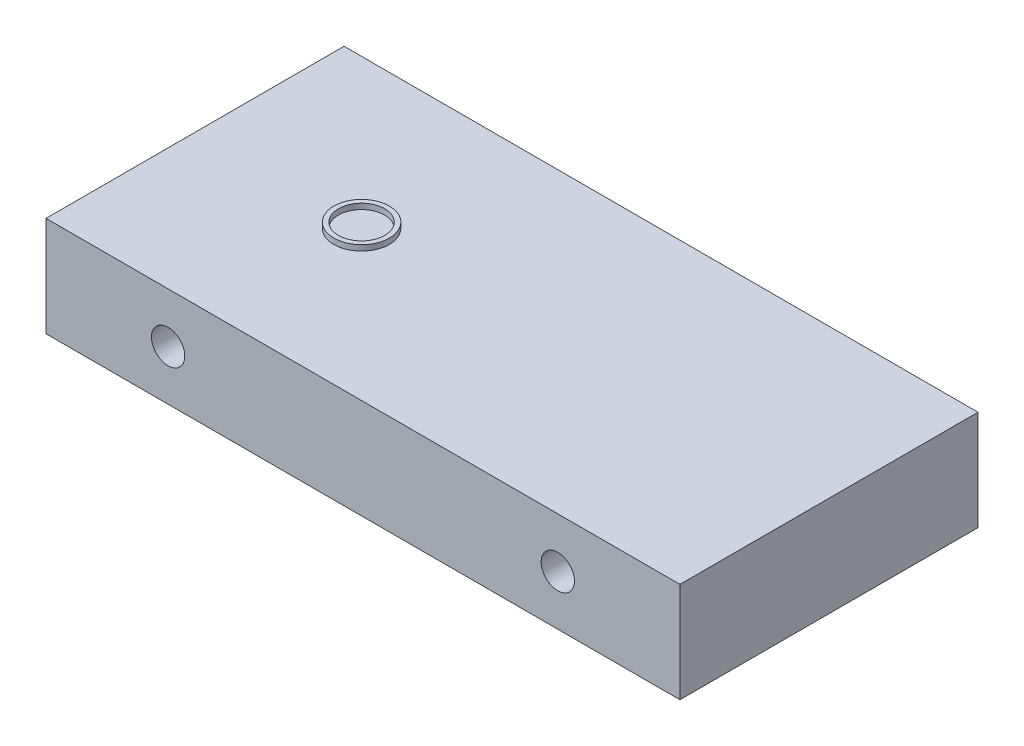
ISO-10303-21;
HEADER;
FILE_DESCRIPTION(('STEP AP214'),'2;1');
FILE_NAME('part.step','',(''),(''),'','','');
FILE_SCHEMA(('AUTOMOTIVE_DESIGN { 1 0 10303 214 1 1 1 1 }'));
ENDSEC;
DATA;
#1=APPLICATION_CONTEXT('core data for automotive mechanical design processes');
#2=APPLICATION_PROTOCOL_DEFINITION('international standard','automotive_design',2000,#1);
#3=PRODUCT_CONTEXT('',#1,'mechanical');
#4=PRODUCT('Part','Part','',(#3));
#5=PRODUCT_RELATED_PRODUCT_CATEGORY('part','',(#4));
#6=PRODUCT_DEFINITION_FORMATION('','',#4);
#7=PRODUCT_DEFINITION_CONTEXT('part definition',#1,'design');
#8=PRODUCT_DEFINITION('design','',#6,#7);
#9=PRODUCT_DEFINITION_SHAPE('','',#8);
#10=(LENGTH_UNIT() NAMED_UNIT(*) SI_UNIT(.MILLI.,.METRE.));
#11=(NAMED_UNIT(*) PLANE_ANGLE_UNIT() SI_UNIT($,.RADIAN.));
#12=(NAMED_UNIT(*) SI_UNIT($,.STERADIAN.) SOLID_ANGLE_UNIT());
#13=UNCERTAINTY_MEASURE_WITH_UNIT(LENGTH_MEASURE(1.E-05),#10,'distance_accuracy_value','');
#14=(GEOMETRIC_REPRESENTATION_CONTEXT(3) GLOBAL_UNCERTAINTY_ASSIGNED_CONTEXT((#13)) GLOBAL_UNIT_ASSIGNED_CONTEXT((#10,
#11,#12)) REPRESENTATION_CONTEXT('',''));
#15=CARTESIAN_POINT('',(0.,0.,0.));
#16=DIRECTION('',(0.,0.,1.));
#17=DIRECTION('',(1.,0.,0.));
#18=AXIS2_PLACEMENT_3D('',#15,#16,#17);
#19=CARTESIAN_POINT('',(171.2717455,54.,80.533893));
#20=DIRECTION('',(-1.,0.,0.));
#21=DIRECTION('',(0.,0.,1.));
#22=AXIS2_PLACEMENT_3D('',#19,#20,#21);
#23=PLANE('',#22);
#24=DIRECTION('',(0.,0.,-1.));
#25=VECTOR('',#24,1.);
#26=CARTESIAN_POINT('',(171.2717455,0.,80.533893));
#27=LINE('',#26,#25);
#28=CARTESIAN_POINT('',(171.2717455,0.,80.533893));
#29=VERTEX_POINT('',#28);
#30=CARTESIAN_POINT('',(171.2717455,0.,-80.533893));
#31=VERTEX_POINT('',#30);
#32=EDGE_CURVE('E104',#29,#31,#27,.T.);
#33=ORIENTED_EDGE('',*,*,#32,.T.);
#34=DIRECTION('',(0.,-1.,0.));
#35=VECTOR('',#34,1.);
#36=CARTESIAN_POINT('',(171.2717455,54.,-80.533893));
#37=LINE('',#36,#35);
#38=CARTESIAN_POINT('',(171.2717455,54.,-80.533893));
#39=VERTEX_POINT('',#38);
#40=EDGE_CURVE('E46',#39,#31,#37,.T.);
#41=ORIENTED_EDGE('',*,*,#40,.F.);
#42=DIRECTION('',(0.,0.,-1.));
#43=VECTOR('',#42,1.);
#44=CARTESIAN_POINT('',(171.2717455,54.,80.533893));
#45=LINE('',#44,#43);
#46=CARTESIAN_POINT('',(171.2717455,54.,80.533893));
#47=VERTEX_POINT('',#46);
#48=EDGE_CURVE('E90',#47,#39,#45,.T.);
#49=ORIENTED_EDGE('',*,*,#48,.F.);
#50=DIRECTION('',(0.,-1.,0.));
#51=VECTOR('',#50,1.);
#52=CARTESIAN_POINT('',(171.2717455,54.,80.533893));
#53=LINE('',#52,#51);
#54=EDGE_CURVE('E100',#47,#29,#53,.T.);
#55=ORIENTED_EDGE('',*,*,#54,.T.);
#56=EDGE_LOOP('',(#33,#41,#49,#55));
#57=FACE_BOUND('',#56,.T.);
#58=ADVANCED_FACE('F38',(#57),#23,.F.);
#59=CARTESIAN_POINT('',(-171.2717455,54.,-80.533893));
#60=DIRECTION('',(0.,0.,1.));
#61=DIRECTION('',(1.,0.,0.));
#62=AXIS2_PLACEMENT_3D('',#59,#60,#61);
#63=PLANE('',#62);
#64=CARTESIAN_POINT('',(105.2849429,27.,-80.533893));
#65=DIRECTION('',(0.,0.,-1.));
#66=DIRECTION('',(-1.,0.,0.));
#67=AXIS2_PLACEMENT_3D('',#64,#65,#66);
#68=CIRCLE('',#67,9.00000000000001);
#69=CARTESIAN_POINT('',(96.2849429000001,27.,-80.533893));
#70=VERTEX_POINT('',#69);
#71=EDGE_CURVE('E116',#70,#70,#68,.T.);
#72=ORIENTED_EDGE('',*,*,#71,.F.);
#73=EDGE_LOOP('',(#72));
#74=FACE_BOUND('',#73,.T.);
#75=CARTESIAN_POINT('',(-105.2849429,27.,-80.533893));
#76=DIRECTION('',(0.,0.,-1.));
#77=DIRECTION('',(-1.,0.,0.));
#78=AXIS2_PLACEMENT_3D('',#75,#76,#77);
#79=CIRCLE('',#78,9.);
#80=CARTESIAN_POINT('',(-114.2849429,27.,-80.533893));
#81=VERTEX_POINT('',#80);
#82=EDGE_CURVE('E247',#81,#81,#79,.T.);
#83=ORIENTED_EDGE('',*,*,#82,.F.);
#84=EDGE_LOOP('',(#83));
#85=FACE_BOUND('',#84,.T.);
#86=DIRECTION('',(-1.,0.,0.));
#87=VECTOR('',#86,1.);
#88=CARTESIAN_POINT('',(-171.2717455,0.,-80.533893));
#89=LINE('',#88,#87);
#90=CARTESIAN_POINT('',(-171.2717455,0.,-80.533893));
#91=VERTEX_POINT('',#90);
#92=EDGE_CURVE('E95',#31,#91,#89,.T.);
#93=ORIENTED_EDGE('',*,*,#92,.T.);
#94=DIRECTION('',(0.,-1.,0.));
#95=VECTOR('',#94,1.);
#96=CARTESIAN_POINT('',(-171.2717455,54.,-80.533893));
#97=LINE('',#96,#95);
#98=CARTESIAN_POINT('',(-171.2717455,54.,-80.533893));
#99=VERTEX_POINT('',#98);
#100=EDGE_CURVE('E93',#99,#91,#97,.T.);
#101=ORIENTED_EDGE('',*,*,#100,.F.);
#102=DIRECTION('',(-1.,0.,0.));
#103=VECTOR('',#102,1.);
#104=CARTESIAN_POINT('',(-171.2717455,54.,-80.533893));
#105=LINE('',#104,#103);
#106=EDGE_CURVE('E85',#39,#99,#105,.T.);
#107=ORIENTED_EDGE('',*,*,#106,.F.);
#108=ORIENTED_EDGE('',*,*,#40,.T.);
#109=EDGE_LOOP('',(#93,#101,#107,#108));
#110=FACE_BOUND('',#109,.T.);
#111=ADVANCED_FACE('F94',(#74,#85,#110),#63,.F.);
#112=CARTESIAN_POINT('',(-171.2717455,54.,80.533893));
#113=DIRECTION('',(1.,0.,0.));
#114=DIRECTION('',(0.,0.,-1.));
#115=AXIS2_PLACEMENT_3D('',#112,#113,#114);
#116=PLANE('',#115);
#117=DIRECTION('',(0.,0.,1.));
#118=VECTOR('',#117,1.);
#119=CARTESIAN_POINT('',(-171.2717455,0.,80.533893));
#120=LINE('',#119,#118);
#121=CARTESIAN_POINT('',(-171.2717455,0.,80.533893));
#122=VERTEX_POINT('',#121);
#123=EDGE_CURVE('E71',#91,#122,#120,.T.);
#124=ORIENTED_EDGE('',*,*,#123,.T.);
#125=DIRECTION('',(0.,-1.,0.));
#126=VECTOR('',#125,1.);
#127=CARTESIAN_POINT('',(-171.2717455,54.,80.533893));
#128=LINE('',#127,#126);
#129=CARTESIAN_POINT('',(-171.2717455,54.,80.533893));
#130=VERTEX_POINT('',#129);
#131=EDGE_CURVE('E96',#130,#122,#128,.T.);
#132=ORIENTED_EDGE('',*,*,#131,.F.);
#133=DIRECTION('',(0.,0.,1.));
#134=VECTOR('',#133,1.);
#135=CARTESIAN_POINT('',(-171.2717455,54.,80.533893));
#136=LINE('',#135,#134);
#137=EDGE_CURVE('E88',#99,#130,#136,.T.);
#138=ORIENTED_EDGE('',*,*,#137,.F.);
#139=ORIENTED_EDGE('',*,*,#100,.T.);
#140=EDGE_LOOP('',(#124,#132,#138,#139));
#141=FACE_BOUND('',#140,.T.);
#142=ADVANCED_FACE('F98',(#141),#116,.F.);
#143=CARTESIAN_POINT('',(-171.2717455,54.,80.533893));
#144=DIRECTION('',(0.,0.,-1.));
#145=DIRECTION('',(-1.,0.,0.));
#146=AXIS2_PLACEMENT_3D('',#143,#144,#145);
#147=PLANE('',#146);
#148=CARTESIAN_POINT('',(105.2849429,27.,80.533893));
#149=DIRECTION('',(0.,0.,-1.));
#150=DIRECTION('',(-1.,0.,0.));
#151=AXIS2_PLACEMENT_3D('',#148,#149,#150);
#152=CIRCLE('',#151,9.00000000000001);
#153=CARTESIAN_POINT('',(96.2849429000001,27.,80.533893));
#154=VERTEX_POINT('',#153);
#155=EDGE_CURVE('E107',#154,#154,#152,.T.);
#156=ORIENTED_EDGE('',*,*,#155,.T.);
#157=EDGE_LOOP('',(#156));
#158=FACE_BOUND('',#157,.T.);
#159=CARTESIAN_POINT('',(-105.2849429,27.,80.533893));
#160=DIRECTION('',(0.,0.,-1.));
#161=DIRECTION('',(-1.,0.,0.));
#162=AXIS2_PLACEMENT_3D('',#159,#160,#161);
#163=CIRCLE('',#162,9.);
#164=CARTESIAN_POINT('',(-114.2849429,27.,80.533893));
#165=VERTEX_POINT('',#164);
#166=EDGE_CURVE('E114',#165,#165,#163,.T.);
#167=ORIENTED_EDGE('',*,*,#166,.T.);
#168=EDGE_LOOP('',(#167));
#169=FACE_BOUND('',#168,.T.);
#170=DIRECTION('',(1.,0.,0.));
#171=VECTOR('',#170,1.);
#172=CARTESIAN_POINT('',(-171.2717455,0.,80.533893));
#173=LINE('',#172,#171);
#174=EDGE_CURVE('E77',#122,#29,#173,.T.);
#175=ORIENTED_EDGE('',*,*,#174,.T.);
#176=ORIENTED_EDGE('',*,*,#54,.F.);
#177=DIRECTION('',(1.,0.,0.));
#178=VECTOR('',#177,1.);
#179=CARTESIAN_POINT('',(-171.2717455,54.,80.533893));
#180=LINE('',#179,#178);
#181=EDGE_CURVE('E54',#130,#47,#180,.T.);
#182=ORIENTED_EDGE('',*,*,#181,.F.);
#183=ORIENTED_EDGE('',*,*,#131,.T.);
#184=EDGE_LOOP('',(#175,#176,#182,#183));
#185=FACE_BOUND('',#184,.T.);
#186=ADVANCED_FACE('F120',(#158,#169,#185),#147,.F.);
#187=CARTESIAN_POINT('',(0.,54.,0.));
#188=DIRECTION('',(0.,-1.,0.));
#189=DIRECTION('',(0.,0.,-1.));
#190=AXIS2_PLACEMENT_3D('',#187,#188,#189);
#191=PLANE('',#190);
#192=CARTESIAN_POINT('',(-81.2717455,54.,0.));
#193=DIRECTION('',(0.,-1.,0.));
#194=DIRECTION('',(0.,0.,-1.));
#195=AXIS2_PLACEMENT_3D('',#192,#193,#194);
#196=CIRCLE('',#195,15.);
#197=CARTESIAN_POINT('',(-81.2717455,54.,-15.));
#198=VERTEX_POINT('',#197);
#199=EDGE_CURVE('E11',#198,#198,#196,.F.);
#200=ORIENTED_EDGE('',*,*,#199,.F.);
#201=EDGE_LOOP('',(#200));
#202=FACE_BOUND('',#201,.T.);
#203=ORIENTED_EDGE('',*,*,#48,.T.);
#204=ORIENTED_EDGE('',*,*,#106,.T.);
#205=ORIENTED_EDGE('',*,*,#137,.T.);
#206=ORIENTED_EDGE('',*,*,#181,.T.);
#207=EDGE_LOOP('',(#203,#204,#205,#206));
#208=FACE_BOUND('',#207,.T.);
#209=ADVANCED_FACE('F86',(#202,#208),#191,.F.);
#210=CARTESIAN_POINT('',(0.,0.,0.));
#211=DIRECTION('',(0.,-1.,0.));
#212=DIRECTION('',(0.,0.,-1.));
#213=AXIS2_PLACEMENT_3D('',#210,#211,#212);
#214=PLANE('',#213);
#215=ORIENTED_EDGE('',*,*,#32,.F.);
#216=ORIENTED_EDGE('',*,*,#174,.F.);
#217=ORIENTED_EDGE('',*,*,#123,.F.);
#218=ORIENTED_EDGE('',*,*,#92,.F.);
#219=EDGE_LOOP('',(#215,#216,#217,#218));
#220=FACE_BOUND('',#219,.T.);
#221=ADVANCED_FACE('F137',(#220),#214,.T.);
#222=CARTESIAN_POINT('',(-105.2849429,27.,259.486107));
#223=DIRECTION('',(0.,0.,-1.));
#224=DIRECTION('',(-1.,0.,0.));
#225=AXIS2_PLACEMENT_3D('',#222,#223,#224);
#226=CYLINDRICAL_SURFACE('',#225,9.);
#227=ORIENTED_EDGE('',*,*,#82,.T.);
#228=EDGE_LOOP('',(#227));
#229=FACE_BOUND('',#228,.T.);
#230=ORIENTED_EDGE('',*,*,#166,.F.);
#231=EDGE_LOOP('',(#230));
#232=FACE_BOUND('',#231,.T.);
#233=ADVANCED_FACE('F126',(#229,#232),#226,.F.);
#234=CARTESIAN_POINT('',(105.2849429,27.,259.486107));
#235=DIRECTION('',(0.,0.,-1.));
#236=DIRECTION('',(-1.,0.,0.));
#237=AXIS2_PLACEMENT_3D('',#234,#235,#236);
#238=CYLINDRICAL_SURFACE('',#237,9.00000000000001);
#239=ORIENTED_EDGE('',*,*,#71,.T.);
#240=EDGE_LOOP('',(#239));
#241=FACE_BOUND('',#240,.T.);
#242=ORIENTED_EDGE('',*,*,#155,.F.);
#243=EDGE_LOOP('',(#242));
#244=FACE_BOUND('',#243,.T.);
#245=ADVANCED_FACE('F123',(#241,#244),#238,.F.);
#246=CARTESIAN_POINT('',(-81.2717455,57.,0.));
#247=DIRECTION('',(0.,1.,0.));
#248=DIRECTION('',(0.,0.,1.));
#249=AXIS2_PLACEMENT_3D('',#246,#247,#248);
#250=PLANE('',#249);
#251=CARTESIAN_POINT('',(-81.2717455,57.,0.));
#252=DIRECTION('',(0.,1.,0.));
#253=DIRECTION('',(0.,0.,1.));
#254=AXIS2_PLACEMENT_3D('',#251,#252,#253);
#255=CIRCLE('',#254,15.);
#256=CARTESIAN_POINT('',(-81.2717455,57.,15.));
#257=VERTEX_POINT('',#256);
#258=EDGE_CURVE('E242',#257,#257,#255,.T.);
#259=ORIENTED_EDGE('',*,*,#258,.T.);
#260=EDGE_LOOP('',(#259));
#261=FACE_BOUND('',#260,.T.);
#262=CARTESIAN_POINT('',(-81.2717455,57.,0.));
#263=DIRECTION('',(0.,1.,0.));
#264=DIRECTION('',(0.,0.,1.));
#265=AXIS2_PLACEMENT_3D('',#262,#263,#264);
#266=CIRCLE('',#265,12.5);
#267=CARTESIAN_POINT('',(-81.2717455,57.,12.5));
#268=VERTEX_POINT('',#267);
#269=EDGE_CURVE('E239',#268,#268,#266,.T.);
#270=ORIENTED_EDGE('',*,*,#269,.F.);
#271=EDGE_LOOP('',(#270));
#272=FACE_BOUND('',#271,.T.);
#273=ADVANCED_FACE('F125',(#261,#272),#250,.T.);
#274=CARTESIAN_POINT('',(-81.2717455,57.,0.));
#275=DIRECTION('',(0.,-1.,0.));
#276=DIRECTION('',(0.,0.,-1.));
#277=AXIS2_PLACEMENT_3D('',#274,#275,#276);
#278=CYLINDRICAL_SURFACE('',#277,15.);
#279=ORIENTED_EDGE('',*,*,#258,.F.);
#280=EDGE_LOOP('',(#279));
#281=FACE_BOUND('',#280,.T.);
#282=ORIENTED_EDGE('',*,*,#199,.T.);
#283=EDGE_LOOP('',(#282));
#284=FACE_BOUND('',#283,.T.);
#285=ADVANCED_FACE('F134',(#281,#284),#278,.T.);
#286=CARTESIAN_POINT('',(-81.2717455,57.,0.));
#287=DIRECTION('',(0.,-1.,0.));
#288=DIRECTION('',(0.,0.,-1.));
#289=AXIS2_PLACEMENT_3D('',#286,#287,#288);
#290=CYLINDRICAL_SURFACE('',#289,12.5);
#291=ORIENTED_EDGE('',*,*,#269,.T.);
#292=EDGE_LOOP('',(#291));
#293=FACE_BOUND('',#292,.T.);
#294=CARTESIAN_POINT('',(-81.2717455,54.,0.));
#295=DIRECTION('',(0.,1.,0.));
#296=DIRECTION('',(0.,0.,1.));
#297=AXIS2_PLACEMENT_3D('',#294,#295,#296);
#298=CIRCLE('',#297,12.5);
#299=CARTESIAN_POINT('',(-81.2717455,54.,12.5));
#300=VERTEX_POINT('',#299);
#301=EDGE_CURVE('E237',#300,#300,#298,.T.);
#302=ORIENTED_EDGE('',*,*,#301,.F.);
#303=EDGE_LOOP('',(#302));
#304=FACE_BOUND('',#303,.T.);
#305=ADVANCED_FACE('F194',(#293,#304),#290,.F.);
#306=ORIENTED_EDGE('',*,*,#301,.T.);
#307=EDGE_LOOP('',(#306));
#308=FACE_BOUND('',#307,.T.);
#309=ADVANCED_FACE('F158',(#308),#191,.F.);
#310=CLOSED_SHELL('',(#58,#111,#142,#186,#209,#221,#233,#245,#273,#285,#305,#309));
#311=MANIFOLD_SOLID_BREP('B2',#310);
#312=ADVANCED_BREP_SHAPE_REPRESENTATION('',(#18,#311),#14);
#313=SHAPE_DEFINITION_REPRESENTATION(#9,#312);
ENDSEC;
END-ISO-10303-21;
